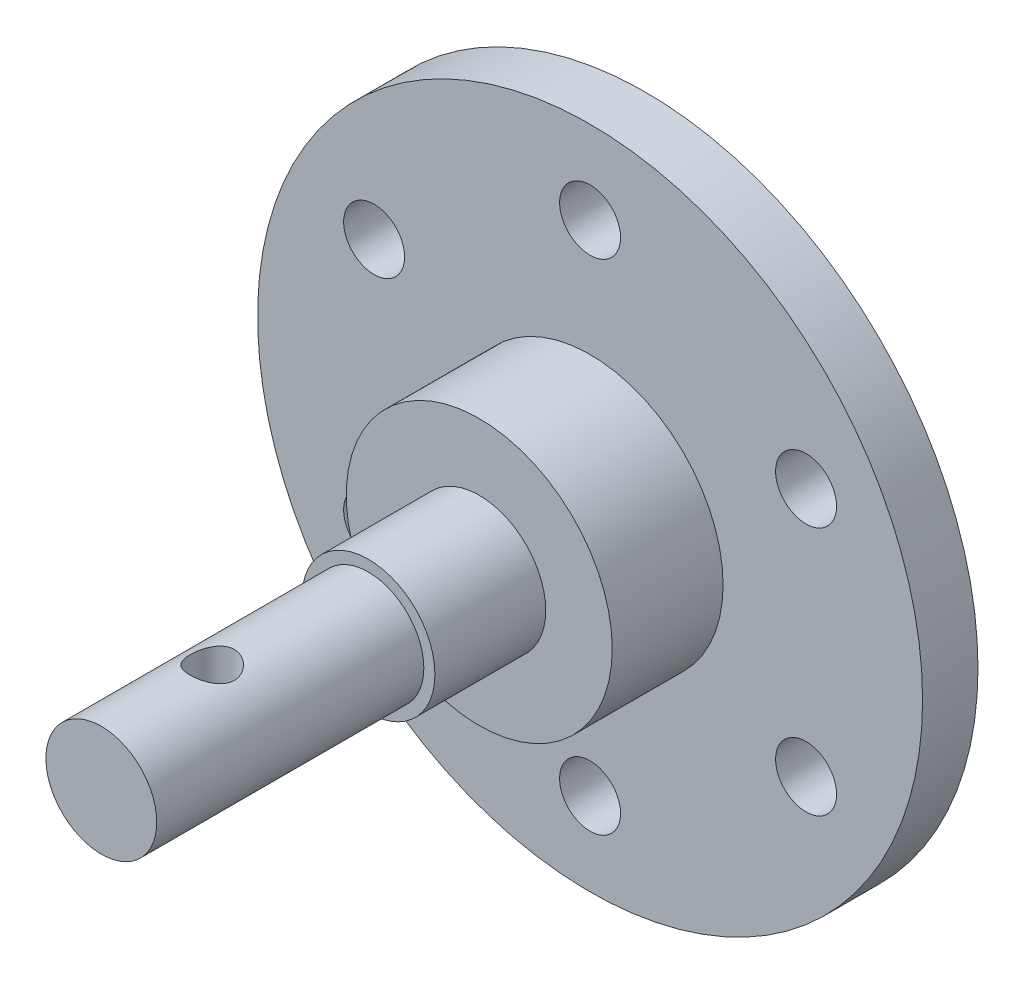
ISO-10303-21;
HEADER;
FILE_DESCRIPTION(('STEP AP214'),'2;1');
FILE_NAME('part.step','',(''),(''),'','','');
FILE_SCHEMA(('AUTOMOTIVE_DESIGN { 1 0 10303 214 1 1 1 1 }'));
ENDSEC;
DATA;
#1=APPLICATION_CONTEXT('core data for automotive mechanical design processes');
#2=APPLICATION_PROTOCOL_DEFINITION('international standard','automotive_design',2000,#1);
#3=PRODUCT_CONTEXT('',#1,'mechanical');
#4=PRODUCT('Part','Part','',(#3));
#5=PRODUCT_RELATED_PRODUCT_CATEGORY('part','',(#4));
#6=PRODUCT_DEFINITION_FORMATION('','',#4);
#7=PRODUCT_DEFINITION_CONTEXT('part definition',#1,'design');
#8=PRODUCT_DEFINITION('design','',#6,#7);
#9=PRODUCT_DEFINITION_SHAPE('','',#8);
#10=(LENGTH_UNIT() NAMED_UNIT(*) SI_UNIT(.MILLI.,.METRE.));
#11=(NAMED_UNIT(*) PLANE_ANGLE_UNIT() SI_UNIT($,.RADIAN.));
#12=(NAMED_UNIT(*) SI_UNIT($,.STERADIAN.) SOLID_ANGLE_UNIT());
#13=UNCERTAINTY_MEASURE_WITH_UNIT(LENGTH_MEASURE(1.E-05),#10,'distance_accuracy_value','');
#14=(GEOMETRIC_REPRESENTATION_CONTEXT(3) GLOBAL_UNCERTAINTY_ASSIGNED_CONTEXT((#13)) GLOBAL_UNIT_ASSIGNED_CONTEXT((#10,
#11,#12)) REPRESENTATION_CONTEXT('',''));
#15=CARTESIAN_POINT('',(0.,0.,0.));
#16=DIRECTION('',(0.,0.,1.));
#17=DIRECTION('',(1.,0.,0.));
#18=AXIS2_PLACEMENT_3D('',#15,#16,#17);
#19=CARTESIAN_POINT('',(0.,0.,49.1));
#20=DIRECTION('',(0.,0.,-1.));
#21=DIRECTION('',(-1.,0.,0.));
#22=AXIS2_PLACEMENT_3D('',#19,#20,#21);
#23=CYLINDRICAL_SURFACE('',#22,5.);
#24=CARTESIAN_POINT('',(0.,0.,49.1));
#25=DIRECTION('',(0.,0.,1.));
#26=DIRECTION('',(1.,0.,0.));
#27=AXIS2_PLACEMENT_3D('',#24,#25,#26);
#28=CIRCLE('',#27,5.);
#29=CARTESIAN_POINT('',(5.,0.,49.1));
#30=VERTEX_POINT('',#29);
#31=EDGE_CURVE('E54',#30,#30,#28,.T.);
#32=ORIENTED_EDGE('',*,*,#31,.F.);
#33=EDGE_LOOP('',(#32));
#34=FACE_BOUND('',#33,.T.);
#35=CARTESIAN_POINT('',(0.,0.,25.));
#36=DIRECTION('',(0.,0.,1.));
#37=DIRECTION('',(1.,0.,0.));
#38=AXIS2_PLACEMENT_3D('',#35,#36,#37);
#39=CIRCLE('',#38,5.);
#40=CARTESIAN_POINT('',(5.,0.,25.));
#41=VERTEX_POINT('',#40);
#42=EDGE_CURVE('E10',#41,#41,#39,.T.);
#43=ORIENTED_EDGE('',*,*,#42,.T.);
#44=EDGE_LOOP('',(#43));
#45=FACE_BOUND('',#44,.T.);
#46=CARTESIAN_POINT('',(0.,-5.,37.1));
#47=CARTESIAN_POINT('',(0.107493005442891,-4.99999271227085,37.1000098518237));
#48=CARTESIAN_POINT('',(0.215172564090672,-4.99649294306933,37.1087177520884));
#49=CARTESIAN_POINT('',(0.427496480417895,-4.98283453100642,37.1432477035212));
#50=CARTESIAN_POINT('',(0.532131777561248,-4.97265778698877,37.1691162790861));
#51=CARTESIAN_POINT('',(0.734953922727402,-4.94674209213118,37.2368760780588));
#52=CARTESIAN_POINT('',(0.833160661616957,-4.93102136364072,37.2787148462167));
#53=CARTESIAN_POINT('',(1.02107197032836,-4.89556610796078,37.3770191733265));
#54=CARTESIAN_POINT('',(1.11077947675099,-4.87583297458057,37.4334796549189));
#55=CARTESIAN_POINT('',(1.28350100757039,-4.83330886170419,37.5622354985609));
#56=CARTESIAN_POINT('',(1.36606227255022,-4.81042296929191,37.6351066562403));
#57=CARTESIAN_POINT('',(1.51817500478472,-4.76460576906194,37.7934000034768));
#58=CARTESIAN_POINT('',(1.58772010713353,-4.74167444453792,37.8788282972117));
#59=CARTESIAN_POINT('',(1.71487456729288,-4.69722791797136,38.0644280702423));
#60=CARTESIAN_POINT('',(1.77181498119547,-4.67582115964951,38.1650864860232));
#61=CARTESIAN_POINT('',(1.86775471903715,-4.63833647186793,38.37553639842));
#62=CARTESIAN_POINT('',(1.90676256428583,-4.62225601244176,38.4853235278484));
#63=CARTESIAN_POINT('',(1.96389882339587,-4.59826357660818,38.7057123335921));
#64=CARTESIAN_POINT('',(1.98289396580565,-4.59001420355605,38.8160512355762));
#65=CARTESIAN_POINT('',(2.00217296164003,-4.58164004049144,39.0386349983073));
#66=CARTESIAN_POINT('',(2.00246601631322,-4.58151125522768,39.150878894625));
#67=CARTESIAN_POINT('',(1.98498936750454,-4.58910500279994,39.3657566714581));
#68=CARTESIAN_POINT('',(1.96847531430514,-4.5962817503845,39.468515714409));
#69=CARTESIAN_POINT('',(1.91994688029782,-4.61676187607836,39.6696595560067));
#70=CARTESIAN_POINT('',(1.88792979480463,-4.63006632321673,39.7680435881103));
#71=CARTESIAN_POINT('',(1.80869473255107,-4.6615948508853,39.960017836196));
#72=CARTESIAN_POINT('',(1.76117986231532,-4.67991379280788,40.0534692390547));
#73=CARTESIAN_POINT('',(1.65250646073221,-4.7193811638989,40.2314158163616));
#74=CARTESIAN_POINT('',(1.59134280510084,-4.74053065456848,40.3159076094028));
#75=CARTESIAN_POINT('',(1.45155059945443,-4.78526736742271,40.480409728802));
#76=CARTESIAN_POINT('',(1.37193746297063,-4.80891664976152,40.559568729446));
#77=CARTESIAN_POINT('',(1.20031442743019,-4.85459824958282,40.703684478002));
#78=CARTESIAN_POINT('',(1.10830206533443,-4.87663024445325,40.7686383974103));
#79=CARTESIAN_POINT('',(0.912077652605841,-4.91714681264548,40.8836174474158));
#80=CARTESIAN_POINT('',(0.807660491346475,-4.93555270095415,40.9333222811971));
#81=CARTESIAN_POINT('',(0.591023765482879,-4.96614828328759,41.0141678610781));
#82=CARTESIAN_POINT('',(0.478808196849671,-4.97834113462382,41.0453180375574));
#83=CARTESIAN_POINT('',(0.256895887607818,-4.99456139506911,41.0864482954197));
#84=CARTESIAN_POINT('',(0.147443293985534,-4.99902945833514,41.0975724542536));
#85=CARTESIAN_POINT('',(-0.0718453098078175,-5.00068478510631,41.1017131005286));
#86=CARTESIAN_POINT('',(-0.181681213223924,-4.99787393582291,41.0947342815475));
#87=CARTESIAN_POINT('',(-0.393432739121986,-4.98557567063753,41.063708247448));
#88=CARTESIAN_POINT('',(-0.495482491775472,-4.97639391345523,41.040442019649));
#89=CARTESIAN_POINT('',(-0.694135428060778,-4.952594414055,40.9785642916902));
#90=CARTESIAN_POINT('',(-0.790737910224844,-4.9379759735653,40.9399508203313));
#91=CARTESIAN_POINT('',(-0.979078785816701,-4.90416594770812,40.8472150603201));
#92=CARTESIAN_POINT('',(-1.0705780227554,-4.88484815979804,40.7926545279569));
#93=CARTESIAN_POINT('',(-1.24344359124655,-4.84373364745525,40.6700596760944));
#94=CARTESIAN_POINT('',(-1.32480584076112,-4.82193593110271,40.6020199570774));
#95=CARTESIAN_POINT('',(-1.48072304302882,-4.77645117638112,40.4491299870504));
#96=CARTESIAN_POINT('',(-1.55447393380606,-4.75273441425052,40.3634664584938));
#97=CARTESIAN_POINT('',(-1.68675119741371,-4.70741672917132,40.1805599169906));
#98=CARTESIAN_POINT('',(-1.74527506133751,-4.68581615526511,40.0833149996601));
#99=CARTESIAN_POINT('',(-1.84580750193163,-4.64714299907709,39.8785383054059));
#100=CARTESIAN_POINT('',(-1.88765059453445,-4.63011630884788,39.7709160007877));
#101=CARTESIAN_POINT('',(-1.9522962197053,-4.60323673477931,39.5492663482849));
#102=CARTESIAN_POINT('',(-1.97511280526931,-4.59337855695998,39.4352437941876));
#103=CARTESIAN_POINT('',(-1.9997156172784,-4.58271759299926,39.2128720982255));
#104=CARTESIAN_POINT('',(-2.00289708230287,-4.58131421008171,39.1047051604067));
#105=CARTESIAN_POINT('',(-1.99180315927752,-4.58614836033098,38.8894551422867));
#106=CARTESIAN_POINT('',(-1.97752998791378,-4.59238492324794,38.7823719260974));
#107=CARTESIAN_POINT('',(-1.93307136615365,-4.61126649079021,38.576667810145));
#108=CARTESIAN_POINT('',(-1.90353749357098,-4.62364831827449,38.477879725567));
#109=CARTESIAN_POINT('',(-1.83000544849101,-4.65324001232697,38.2866213703865));
#110=CARTESIAN_POINT('',(-1.78600328139381,-4.67045121206007,38.1941528531002));
#111=CARTESIAN_POINT('',(-1.68187276275973,-4.70898609604492,38.0123903807292));
#112=CARTESIAN_POINT('',(-1.62096533515949,-4.73048882313242,37.9235813298695));
#113=CARTESIAN_POINT('',(-1.48589211927149,-4.77463804372237,37.7570066827962));
#114=CARTESIAN_POINT('',(-1.41172233481812,-4.79728488048406,37.6792444278717));
#115=CARTESIAN_POINT('',(-1.24650550627246,-4.84293567087394,37.5317971467364));
#116=CARTESIAN_POINT('',(-1.15467600114614,-4.86586757962185,37.4629626931019));
#117=CARTESIAN_POINT('',(-0.95990032028578,-4.90800406713717,37.3416629573784));
#118=CARTESIAN_POINT('',(-0.85694900454724,-4.92720691092906,37.2892052878475));
#119=CARTESIAN_POINT('',(-0.644738062495206,-4.95939714815861,37.2033777848097));
#120=CARTESIAN_POINT('',(-0.535631618219698,-4.97249363055028,37.1696706764397));
#121=CARTESIAN_POINT('',(-0.312876546281221,-4.99144306209366,37.1213608790457));
#122=CARTESIAN_POINT('',(-0.199243525858912,-4.99731899495638,37.1066975632561));
#123=CARTESIAN_POINT('',(-0.0569122978909287,-4.99975899504136,37.1006046190217));
#124=CARTESIAN_POINT('',(-0.0284626887407579,-5.00000192969176,37.0999973913708));
#125=CARTESIAN_POINT('',(0.,-5.,37.1));
#126=B_SPLINE_CURVE_WITH_KNOTS('',3,(#46,#47,#48,#49,#50,#51,#52,#53,#54,#55,#56,#57,#58,#59,
#60,#61,#62,#63,#64,#65,#66,#67,#68,#69,#70,#71,#72,#73,#74,#75,#76,#77,#78,#79,#80,#81,#82,#83,
#84,#85,#86,#87,#88,#89,#90,#91,#92,#93,#94,#95,#96,#97,#98,#99,#100,#101,#102,#103,#104,#105,
#106,#107,#108,#109,#110,#111,#112,#113,#114,#115,#116,#117,#118,#119,#120,#121,#122,#123,#124,
#125),.UNSPECIFIED.,.T.,.F.,(4,2,2,2,2,2,2,2,2,2,2,2,2,2,2,2,2,2,2,2,2,2,2,2,2,2,2,2,2,2,2,2,2,
2,2,2,2,2,2,4),(0.,0.32240298789307,0.645683636007934,0.967911457471577,1.29002753567984,
1.62597381700397,1.96208394934412,2.31315258819216,2.66405423118268,2.99904105308829,
3.33386306340488,3.64538328401372,3.95695787256048,4.27489126298816,4.59294421938184,
4.93558349186558,5.27829092839733,5.62776913162807,5.97706956113791,6.30569184528007,
6.63422893570082,6.94800455564365,7.26182048993796,7.58523513398262,7.90877959498969,
8.25368474624413,8.59864669043748,8.94695045140828,9.29499672645933,9.61799673392748,
9.94095572563046,10.2511431854877,10.5614163580516,10.8894546805669,11.2175920134839,
11.5670042353384,11.9165786364053,12.2596430101332,12.6016125240434,12.686980458968),.UNSPECIFIED.);
#127=CARTESIAN_POINT('',(0.,-5.,37.1));
#128=VERTEX_POINT('',#127);
#129=EDGE_CURVE('E104',#128,#128,#126,.T.);
#130=ORIENTED_EDGE('',*,*,#129,.F.);
#131=EDGE_LOOP('',(#130));
#132=FACE_BOUND('',#131,.T.);
#133=CARTESIAN_POINT('',(0.,5.,37.1));
#134=CARTESIAN_POINT('',(-0.107493005442891,4.99999271227085,37.1000098518237));
#135=CARTESIAN_POINT('',(-0.215172564090672,4.99649294306933,37.1087177520884));
#136=CARTESIAN_POINT('',(-0.427496480417895,4.98283453100642,37.1432477035212));
#137=CARTESIAN_POINT('',(-0.532131777561248,4.97265778698877,37.1691162790861));
#138=CARTESIAN_POINT('',(-0.734953922727402,4.94674209213118,37.2368760780588));
#139=CARTESIAN_POINT('',(-0.833160661616957,4.93102136364072,37.2787148462167));
#140=CARTESIAN_POINT('',(-1.02107197032836,4.89556610796078,37.3770191733265));
#141=CARTESIAN_POINT('',(-1.11077947675099,4.87583297458057,37.4334796549189));
#142=CARTESIAN_POINT('',(-1.28350100757039,4.83330886170419,37.5622354985609));
#143=CARTESIAN_POINT('',(-1.36606227255022,4.81042296929191,37.6351066562403));
#144=CARTESIAN_POINT('',(-1.51817500478472,4.76460576906194,37.7934000034768));
#145=CARTESIAN_POINT('',(-1.58772010713353,4.74167444453792,37.8788282972117));
#146=CARTESIAN_POINT('',(-1.71487456729288,4.69722791797136,38.0644280702423));
#147=CARTESIAN_POINT('',(-1.77181498119547,4.67582115964951,38.1650864860232));
#148=CARTESIAN_POINT('',(-1.86775471903715,4.63833647186793,38.37553639842));
#149=CARTESIAN_POINT('',(-1.90676256428583,4.62225601244176,38.4853235278484));
#150=CARTESIAN_POINT('',(-1.96389882339587,4.59826357660818,38.7057123335921));
#151=CARTESIAN_POINT('',(-1.98289396580565,4.59001420355605,38.8160512355762));
#152=CARTESIAN_POINT('',(-2.00217296164003,4.58164004049144,39.0386349983073));
#153=CARTESIAN_POINT('',(-2.00246601631322,4.58151125522768,39.150878894625));
#154=CARTESIAN_POINT('',(-1.98498936750454,4.58910500279994,39.3657566714581));
#155=CARTESIAN_POINT('',(-1.96847531430514,4.5962817503845,39.468515714409));
#156=CARTESIAN_POINT('',(-1.91994688029782,4.61676187607836,39.6696595560067));
#157=CARTESIAN_POINT('',(-1.88792979480463,4.63006632321673,39.7680435881103));
#158=CARTESIAN_POINT('',(-1.80869473255107,4.6615948508853,39.960017836196));
#159=CARTESIAN_POINT('',(-1.76117986231532,4.67991379280788,40.0534692390547));
#160=CARTESIAN_POINT('',(-1.65250646073221,4.7193811638989,40.2314158163616));
#161=CARTESIAN_POINT('',(-1.59134280510084,4.74053065456848,40.3159076094028));
#162=CARTESIAN_POINT('',(-1.45155059945443,4.78526736742271,40.480409728802));
#163=CARTESIAN_POINT('',(-1.37193746297063,4.80891664976152,40.559568729446));
#164=CARTESIAN_POINT('',(-1.20031442743019,4.85459824958282,40.703684478002));
#165=CARTESIAN_POINT('',(-1.10830206533443,4.87663024445325,40.7686383974103));
#166=CARTESIAN_POINT('',(-0.912077652605841,4.91714681264548,40.8836174474158));
#167=CARTESIAN_POINT('',(-0.807660491346475,4.93555270095415,40.9333222811971));
#168=CARTESIAN_POINT('',(-0.591023765482879,4.96614828328759,41.0141678610781));
#169=CARTESIAN_POINT('',(-0.478808196849671,4.97834113462382,41.0453180375574));
#170=CARTESIAN_POINT('',(-0.256895887607818,4.99456139506911,41.0864482954197));
#171=CARTESIAN_POINT('',(-0.147443293985534,4.99902945833514,41.0975724542536));
#172=CARTESIAN_POINT('',(0.0718453098078175,5.00068478510631,41.1017131005286));
#173=CARTESIAN_POINT('',(0.181681213223924,4.99787393582291,41.0947342815475));
#174=CARTESIAN_POINT('',(0.393432739121986,4.98557567063753,41.063708247448));
#175=CARTESIAN_POINT('',(0.495482491775472,4.97639391345523,41.040442019649));
#176=CARTESIAN_POINT('',(0.694135428060778,4.952594414055,40.9785642916902));
#177=CARTESIAN_POINT('',(0.790737910224844,4.9379759735653,40.9399508203313));
#178=CARTESIAN_POINT('',(0.979078785816701,4.90416594770812,40.8472150603201));
#179=CARTESIAN_POINT('',(1.0705780227554,4.88484815979804,40.7926545279569));
#180=CARTESIAN_POINT('',(1.24344359124655,4.84373364745525,40.6700596760944));
#181=CARTESIAN_POINT('',(1.32480584076112,4.82193593110271,40.6020199570774));
#182=CARTESIAN_POINT('',(1.48072304302882,4.77645117638112,40.4491299870504));
#183=CARTESIAN_POINT('',(1.55447393380606,4.75273441425052,40.3634664584938));
#184=CARTESIAN_POINT('',(1.68675119741371,4.70741672917132,40.1805599169906));
#185=CARTESIAN_POINT('',(1.74527506133751,4.68581615526511,40.0833149996601));
#186=CARTESIAN_POINT('',(1.84580750193163,4.64714299907709,39.8785383054059));
#187=CARTESIAN_POINT('',(1.88765059453445,4.63011630884788,39.7709160007877));
#188=CARTESIAN_POINT('',(1.9522962197053,4.60323673477931,39.5492663482849));
#189=CARTESIAN_POINT('',(1.97511280526931,4.59337855695998,39.4352437941876));
#190=CARTESIAN_POINT('',(1.9997156172784,4.58271759299926,39.2128720982255));
#191=CARTESIAN_POINT('',(2.00289708230287,4.58131421008171,39.1047051604067));
#192=CARTESIAN_POINT('',(1.99180315927752,4.58614836033098,38.8894551422867));
#193=CARTESIAN_POINT('',(1.97752998791378,4.59238492324794,38.7823719260974));
#194=CARTESIAN_POINT('',(1.93307136615365,4.61126649079021,38.576667810145));
#195=CARTESIAN_POINT('',(1.90353749357098,4.62364831827449,38.477879725567));
#196=CARTESIAN_POINT('',(1.83000544849101,4.65324001232697,38.2866213703865));
#197=CARTESIAN_POINT('',(1.78600328139381,4.67045121206007,38.1941528531002));
#198=CARTESIAN_POINT('',(1.68187276275973,4.70898609604492,38.0123903807292));
#199=CARTESIAN_POINT('',(1.62096533515949,4.73048882313242,37.9235813298695));
#200=CARTESIAN_POINT('',(1.48589211927149,4.77463804372237,37.7570066827962));
#201=CARTESIAN_POINT('',(1.41172233481812,4.79728488048406,37.6792444278717));
#202=CARTESIAN_POINT('',(1.24650550627246,4.84293567087394,37.5317971467364));
#203=CARTESIAN_POINT('',(1.15467600114614,4.86586757962185,37.4629626931019));
#204=CARTESIAN_POINT('',(0.95990032028578,4.90800406713717,37.3416629573784));
#205=CARTESIAN_POINT('',(0.85694900454724,4.92720691092906,37.2892052878475));
#206=CARTESIAN_POINT('',(0.644738062495206,4.95939714815861,37.2033777848097));
#207=CARTESIAN_POINT('',(0.535631618219698,4.97249363055028,37.1696706764397));
#208=CARTESIAN_POINT('',(0.312876546281221,4.99144306209366,37.1213608790457));
#209=CARTESIAN_POINT('',(0.199243525858912,4.99731899495638,37.1066975632561));
#210=CARTESIAN_POINT('',(0.0569122978909287,4.99975899504136,37.1006046190217));
#211=CARTESIAN_POINT('',(0.0284626887407579,5.00000192969176,37.0999973913708));
#212=CARTESIAN_POINT('',(0.,5.,37.1));
#213=B_SPLINE_CURVE_WITH_KNOTS('',3,(#133,#134,#135,#136,#137,#138,#139,#140,#141,#142,#143,
#144,#145,#146,#147,#148,#149,#150,#151,#152,#153,#154,#155,#156,#157,#158,#159,#160,#161,#162,
#163,#164,#165,#166,#167,#168,#169,#170,#171,#172,#173,#174,#175,#176,#177,#178,#179,#180,#181,
#182,#183,#184,#185,#186,#187,#188,#189,#190,#191,#192,#193,#194,#195,#196,#197,#198,#199,#200,
#201,#202,#203,#204,#205,#206,#207,#208,#209,#210,#211,#212),.UNSPECIFIED.,.T.,.F.,(4,2,2,2,2,2,
2,2,2,2,2,2,2,2,2,2,2,2,2,2,2,2,2,2,2,2,2,2,2,2,2,2,2,2,2,2,2,2,2,4),(0.,0.32240298789307,
0.645683636007934,0.967911457471577,1.29002753567984,1.62597381700397,1.96208394934412,
2.31315258819216,2.66405423118268,2.99904105308829,3.33386306340488,3.64538328401372,
3.95695787256048,4.27489126298816,4.59294421938184,4.93558349186558,5.27829092839733,
5.62776913162807,5.97706956113791,6.30569184528007,6.63422893570082,6.94800455564365,
7.26182048993796,7.58523513398262,7.90877959498969,8.25368474624413,8.59864669043748,
8.94695045140828,9.29499672645933,9.61799673392748,9.94095572563046,10.2511431854877,
10.5614163580516,10.8894546805669,11.2175920134839,11.5670042353384,11.9165786364053,
12.2596430101332,12.6016125240434,12.686980458968),.UNSPECIFIED.);
#214=CARTESIAN_POINT('',(0.,5.,37.1));
#215=VERTEX_POINT('',#214);
#216=EDGE_CURVE('E37',#215,#215,#213,.T.);
#217=ORIENTED_EDGE('',*,*,#216,.F.);
#218=EDGE_LOOP('',(#217));
#219=FACE_BOUND('',#218,.T.);
#220=ADVANCED_FACE('F33',(#34,#45,#132,#219),#23,.T.);
#221=CARTESIAN_POINT('',(0.,0.,5.));
#222=DIRECTION('',(0.,0.,1.));
#223=DIRECTION('',(1.,0.,0.));
#224=AXIS2_PLACEMENT_3D('',#221,#222,#223);
#225=PLANE('',#224);
#226=CARTESIAN_POINT('',(0.,0.,5.));
#227=DIRECTION('',(0.,0.,1.));
#228=DIRECTION('',(1.,0.,0.));
#229=AXIS2_PLACEMENT_3D('',#226,#227,#228);
#230=CIRCLE('',#229,12.);
#231=CARTESIAN_POINT('',(12.,0.,5.));
#232=VERTEX_POINT('',#231);
#233=EDGE_CURVE('E57',#232,#232,#230,.T.);
#234=ORIENTED_EDGE('',*,*,#233,.F.);
#235=EDGE_LOOP('',(#234));
#236=FACE_BOUND('',#235,.T.);
#237=CARTESIAN_POINT('',(-19.4855715851484,-11.2500000000008,5.));
#238=DIRECTION('',(0.,0.,1.));
#239=DIRECTION('',(1.,0.,0.));
#240=AXIS2_PLACEMENT_3D('',#237,#238,#239);
#241=CIRCLE('',#240,2.75000000000183);
#242=CARTESIAN_POINT('',(-16.7355715851466,-11.2500000000008,5.));
#243=VERTEX_POINT('',#242);
#244=EDGE_CURVE('E71',#243,#243,#241,.T.);
#245=ORIENTED_EDGE('',*,*,#244,.F.);
#246=EDGE_LOOP('',(#245));
#247=FACE_BOUND('',#246,.T.);
#248=CARTESIAN_POINT('',(19.4855715851513,-11.2499999999992,5.));
#249=DIRECTION('',(0.,0.,1.));
#250=DIRECTION('',(1.,0.,0.));
#251=AXIS2_PLACEMENT_3D('',#248,#249,#250);
#252=CIRCLE('',#251,2.75000000000123);
#253=CARTESIAN_POINT('',(22.2355715851525,-11.2499999999992,5.));
#254=VERTEX_POINT('',#253);
#255=EDGE_CURVE('E83',#254,#254,#252,.T.);
#256=ORIENTED_EDGE('',*,*,#255,.F.);
#257=EDGE_LOOP('',(#256));
#258=FACE_BOUND('',#257,.T.);
#259=CARTESIAN_POINT('',(0.,22.5,5.));
#260=DIRECTION('',(0.,0.,1.));
#261=DIRECTION('',(1.,0.,0.));
#262=AXIS2_PLACEMENT_3D('',#259,#260,#261);
#263=CIRCLE('',#262,2.75);
#264=CARTESIAN_POINT('',(2.75,22.5,5.));
#265=VERTEX_POINT('',#264);
#266=EDGE_CURVE('E95',#265,#265,#263,.T.);
#267=ORIENTED_EDGE('',*,*,#266,.F.);
#268=EDGE_LOOP('',(#267));
#269=FACE_BOUND('',#268,.T.);
#270=CARTESIAN_POINT('',(0.,0.,5.));
#271=DIRECTION('',(0.,0.,1.));
#272=DIRECTION('',(1.,0.,0.));
#273=AXIS2_PLACEMENT_3D('',#270,#271,#272);
#274=CIRCLE('',#273,30.);
#275=CARTESIAN_POINT('',(30.,0.,5.));
#276=VERTEX_POINT('',#275);
#277=EDGE_CURVE('E50',#276,#276,#274,.T.);
#278=ORIENTED_EDGE('',*,*,#277,.T.);
#279=EDGE_LOOP('',(#278));
#280=FACE_BOUND('',#279,.T.);
#281=CARTESIAN_POINT('',(19.4855715851503,11.2500000000008,5.));
#282=DIRECTION('',(0.,0.,1.));
#283=DIRECTION('',(1.,0.,0.));
#284=AXIS2_PLACEMENT_3D('',#281,#282,#283);
#285=CIRCLE('',#284,2.75000000000027);
#286=CARTESIAN_POINT('',(22.2355715851506,11.2500000000008,5.));
#287=VERTEX_POINT('',#286);
#288=EDGE_CURVE('E89',#287,#287,#285,.T.);
#289=ORIENTED_EDGE('',*,*,#288,.F.);
#290=EDGE_LOOP('',(#289));
#291=FACE_BOUND('',#290,.T.);
#292=CARTESIAN_POINT('',(1.91295447595611E-12,-22.5,5.));
#293=DIRECTION('',(0.,0.,1.));
#294=DIRECTION('',(1.,0.,0.));
#295=AXIS2_PLACEMENT_3D('',#292,#293,#294);
#296=CIRCLE('',#295,2.75000000000198);
#297=CARTESIAN_POINT('',(2.75000000000389,-22.5,5.));
#298=VERTEX_POINT('',#297);
#299=EDGE_CURVE('E77',#298,#298,#296,.T.);
#300=ORIENTED_EDGE('',*,*,#299,.F.);
#301=EDGE_LOOP('',(#300));
#302=FACE_BOUND('',#301,.T.);
#303=CARTESIAN_POINT('',(-19.4855715851494,11.2499999999992,5.));
#304=DIRECTION('',(0.,0.,1.));
#305=DIRECTION('',(1.,0.,0.));
#306=AXIS2_PLACEMENT_3D('',#303,#304,#305);
#307=CIRCLE('',#306,2.75000000000097);
#308=CARTESIAN_POINT('',(-16.7355715851484,11.2499999999992,5.));
#309=VERTEX_POINT('',#308);
#310=EDGE_CURVE('E65',#309,#309,#307,.T.);
#311=ORIENTED_EDGE('',*,*,#310,.F.);
#312=EDGE_LOOP('',(#311));
#313=FACE_BOUND('',#312,.T.);
#314=ADVANCED_FACE('F127',(#236,#247,#258,#269,#280,#291,#302,#313),#225,.T.);
#315=CARTESIAN_POINT('',(0.,0.,0.));
#316=DIRECTION('',(0.,0.,1.));
#317=DIRECTION('',(1.,0.,0.));
#318=AXIS2_PLACEMENT_3D('',#315,#316,#317);
#319=PLANE('',#318);
#320=CARTESIAN_POINT('',(0.,0.,0.));
#321=DIRECTION('',(0.,0.,1.));
#322=DIRECTION('',(1.,0.,0.));
#323=AXIS2_PLACEMENT_3D('',#320,#321,#322);
#324=CIRCLE('',#323,30.);
#325=CARTESIAN_POINT('',(30.,0.,0.));
#326=VERTEX_POINT('',#325);
#327=EDGE_CURVE('E98',#326,#326,#324,.T.);
#328=ORIENTED_EDGE('',*,*,#327,.F.);
#329=EDGE_LOOP('',(#328));
#330=FACE_BOUND('',#329,.T.);
#331=CARTESIAN_POINT('',(0.,22.5,0.));
#332=DIRECTION('',(0.,0.,1.));
#333=DIRECTION('',(1.,0.,0.));
#334=AXIS2_PLACEMENT_3D('',#331,#332,#333);
#335=CIRCLE('',#334,2.75);
#336=CARTESIAN_POINT('',(2.75,22.5,0.));
#337=VERTEX_POINT('',#336);
#338=EDGE_CURVE('E92',#337,#337,#335,.T.);
#339=ORIENTED_EDGE('',*,*,#338,.T.);
#340=EDGE_LOOP('',(#339));
#341=FACE_BOUND('',#340,.T.);
#342=CARTESIAN_POINT('',(19.4855715851503,11.2500000000008,0.));
#343=DIRECTION('',(0.,0.,1.));
#344=DIRECTION('',(1.,0.,0.));
#345=AXIS2_PLACEMENT_3D('',#342,#343,#344);
#346=CIRCLE('',#345,2.75000000000027);
#347=CARTESIAN_POINT('',(22.2355715851506,11.2500000000008,0.));
#348=VERTEX_POINT('',#347);
#349=EDGE_CURVE('E86',#348,#348,#346,.T.);
#350=ORIENTED_EDGE('',*,*,#349,.T.);
#351=EDGE_LOOP('',(#350));
#352=FACE_BOUND('',#351,.T.);
#353=CARTESIAN_POINT('',(19.4855715851513,-11.2499999999992,0.));
#354=DIRECTION('',(0.,0.,1.));
#355=DIRECTION('',(1.,0.,0.));
#356=AXIS2_PLACEMENT_3D('',#353,#354,#355);
#357=CIRCLE('',#356,2.75000000000123);
#358=CARTESIAN_POINT('',(22.2355715851525,-11.2499999999992,0.));
#359=VERTEX_POINT('',#358);
#360=EDGE_CURVE('E80',#359,#359,#357,.T.);
#361=ORIENTED_EDGE('',*,*,#360,.T.);
#362=EDGE_LOOP('',(#361));
#363=FACE_BOUND('',#362,.T.);
#364=CARTESIAN_POINT('',(1.91295447595611E-12,-22.5,0.));
#365=DIRECTION('',(0.,0.,1.));
#366=DIRECTION('',(1.,0.,0.));
#367=AXIS2_PLACEMENT_3D('',#364,#365,#366);
#368=CIRCLE('',#367,2.75000000000198);
#369=CARTESIAN_POINT('',(2.75000000000389,-22.5,0.));
#370=VERTEX_POINT('',#369);
#371=EDGE_CURVE('E74',#370,#370,#368,.T.);
#372=ORIENTED_EDGE('',*,*,#371,.T.);
#373=EDGE_LOOP('',(#372));
#374=FACE_BOUND('',#373,.T.);
#375=CARTESIAN_POINT('',(-19.4855715851484,-11.2500000000008,0.));
#376=DIRECTION('',(0.,0.,1.));
#377=DIRECTION('',(1.,0.,0.));
#378=AXIS2_PLACEMENT_3D('',#375,#376,#377);
#379=CIRCLE('',#378,2.75000000000183);
#380=CARTESIAN_POINT('',(-16.7355715851466,-11.2500000000008,0.));
#381=VERTEX_POINT('',#380);
#382=EDGE_CURVE('E68',#381,#381,#379,.T.);
#383=ORIENTED_EDGE('',*,*,#382,.T.);
#384=EDGE_LOOP('',(#383));
#385=FACE_BOUND('',#384,.T.);
#386=CARTESIAN_POINT('',(-19.4855715851494,11.2499999999992,0.));
#387=DIRECTION('',(0.,0.,1.));
#388=DIRECTION('',(1.,0.,0.));
#389=AXIS2_PLACEMENT_3D('',#386,#387,#388);
#390=CIRCLE('',#389,2.75000000000097);
#391=CARTESIAN_POINT('',(-16.7355715851484,11.2499999999992,0.));
#392=VERTEX_POINT('',#391);
#393=EDGE_CURVE('E62',#392,#392,#390,.T.);
#394=ORIENTED_EDGE('',*,*,#393,.T.);
#395=EDGE_LOOP('',(#394));
#396=FACE_BOUND('',#395,.T.);
#397=ADVANCED_FACE('F132',(#330,#341,#352,#363,#374,#385,#396),#319,.F.);
#398=CARTESIAN_POINT('',(0.,0.,5.));
#399=DIRECTION('',(0.,0.,-1.));
#400=DIRECTION('',(-1.,0.,0.));
#401=AXIS2_PLACEMENT_3D('',#398,#399,#400);
#402=CYLINDRICAL_SURFACE('',#401,30.);
#403=ORIENTED_EDGE('',*,*,#277,.F.);
#404=EDGE_LOOP('',(#403));
#405=FACE_BOUND('',#404,.T.);
#406=ORIENTED_EDGE('',*,*,#327,.T.);
#407=EDGE_LOOP('',(#406));
#408=FACE_BOUND('',#407,.T.);
#409=ADVANCED_FACE('F35',(#405,#408),#402,.T.);
#410=CARTESIAN_POINT('',(0.,22.5,5.));
#411=DIRECTION('',(0.,0.,-1.));
#412=DIRECTION('',(-1.,0.,0.));
#413=AXIS2_PLACEMENT_3D('',#410,#411,#412);
#414=CYLINDRICAL_SURFACE('',#413,2.75);
#415=ORIENTED_EDGE('',*,*,#266,.T.);
#416=EDGE_LOOP('',(#415));
#417=FACE_BOUND('',#416,.T.);
#418=ORIENTED_EDGE('',*,*,#338,.F.);
#419=EDGE_LOOP('',(#418));
#420=FACE_BOUND('',#419,.T.);
#421=ADVANCED_FACE('F149',(#417,#420),#414,.F.);
#422=CARTESIAN_POINT('',(19.4855715851503,11.2500000000008,5.));
#423=DIRECTION('',(0.,0.,-1.));
#424=DIRECTION('',(-1.,0.,0.));
#425=AXIS2_PLACEMENT_3D('',#422,#423,#424);
#426=CYLINDRICAL_SURFACE('',#425,2.75000000000027);
#427=ORIENTED_EDGE('',*,*,#288,.T.);
#428=EDGE_LOOP('',(#427));
#429=FACE_BOUND('',#428,.T.);
#430=ORIENTED_EDGE('',*,*,#349,.F.);
#431=EDGE_LOOP('',(#430));
#432=FACE_BOUND('',#431,.T.);
#433=ADVANCED_FACE('F152',(#429,#432),#426,.F.);
#434=CARTESIAN_POINT('',(19.4855715851513,-11.2499999999992,5.));
#435=DIRECTION('',(0.,0.,-1.));
#436=DIRECTION('',(-1.,0.,0.));
#437=AXIS2_PLACEMENT_3D('',#434,#435,#436);
#438=CYLINDRICAL_SURFACE('',#437,2.75000000000123);
#439=ORIENTED_EDGE('',*,*,#255,.T.);
#440=EDGE_LOOP('',(#439));
#441=FACE_BOUND('',#440,.T.);
#442=ORIENTED_EDGE('',*,*,#360,.F.);
#443=EDGE_LOOP('',(#442));
#444=FACE_BOUND('',#443,.T.);
#445=ADVANCED_FACE('F156',(#441,#444),#438,.F.);
#446=CARTESIAN_POINT('',(1.91295447595611E-12,-22.5,5.));
#447=DIRECTION('',(0.,0.,-1.));
#448=DIRECTION('',(-1.,0.,0.));
#449=AXIS2_PLACEMENT_3D('',#446,#447,#448);
#450=CYLINDRICAL_SURFACE('',#449,2.75000000000198);
#451=ORIENTED_EDGE('',*,*,#299,.T.);
#452=EDGE_LOOP('',(#451));
#453=FACE_BOUND('',#452,.T.);
#454=ORIENTED_EDGE('',*,*,#371,.F.);
#455=EDGE_LOOP('',(#454));
#456=FACE_BOUND('',#455,.T.);
#457=ADVANCED_FACE('F160',(#453,#456),#450,.F.);
#458=CARTESIAN_POINT('',(-19.4855715851484,-11.2500000000008,5.));
#459=DIRECTION('',(0.,0.,-1.));
#460=DIRECTION('',(-1.,0.,0.));
#461=AXIS2_PLACEMENT_3D('',#458,#459,#460);
#462=CYLINDRICAL_SURFACE('',#461,2.75000000000183);
#463=ORIENTED_EDGE('',*,*,#244,.T.);
#464=EDGE_LOOP('',(#463));
#465=FACE_BOUND('',#464,.T.);
#466=ORIENTED_EDGE('',*,*,#382,.F.);
#467=EDGE_LOOP('',(#466));
#468=FACE_BOUND('',#467,.T.);
#469=ADVANCED_FACE('F164',(#465,#468),#462,.F.);
#470=CARTESIAN_POINT('',(-19.4855715851494,11.2499999999992,5.));
#471=DIRECTION('',(0.,0.,-1.));
#472=DIRECTION('',(-1.,0.,0.));
#473=AXIS2_PLACEMENT_3D('',#470,#471,#472);
#474=CYLINDRICAL_SURFACE('',#473,2.75000000000097);
#475=ORIENTED_EDGE('',*,*,#310,.T.);
#476=EDGE_LOOP('',(#475));
#477=FACE_BOUND('',#476,.T.);
#478=ORIENTED_EDGE('',*,*,#393,.F.);
#479=EDGE_LOOP('',(#478));
#480=FACE_BOUND('',#479,.T.);
#481=ADVANCED_FACE('F168',(#477,#480),#474,.F.);
#482=CARTESIAN_POINT('',(0.,0.,15.));
#483=DIRECTION('',(0.,0.,-1.));
#484=DIRECTION('',(-1.,0.,0.));
#485=AXIS2_PLACEMENT_3D('',#482,#483,#484);
#486=CYLINDRICAL_SURFACE('',#485,12.);
#487=CARTESIAN_POINT('',(0.,0.,15.));
#488=DIRECTION('',(0.,0.,1.));
#489=DIRECTION('',(1.,0.,0.));
#490=AXIS2_PLACEMENT_3D('',#487,#488,#489);
#491=CIRCLE('',#490,12.);
#492=CARTESIAN_POINT('',(12.,0.,15.));
#493=VERTEX_POINT('',#492);
#494=EDGE_CURVE('E59',#493,#493,#491,.T.);
#495=ORIENTED_EDGE('',*,*,#494,.F.);
#496=EDGE_LOOP('',(#495));
#497=FACE_BOUND('',#496,.T.);
#498=ORIENTED_EDGE('',*,*,#233,.T.);
#499=EDGE_LOOP('',(#498));
#500=FACE_BOUND('',#499,.T.);
#501=ADVANCED_FACE('F172',(#497,#500),#486,.T.);
#502=CARTESIAN_POINT('',(0.,0.,15.));
#503=DIRECTION('',(0.,0.,1.));
#504=DIRECTION('',(1.,0.,0.));
#505=AXIS2_PLACEMENT_3D('',#502,#503,#504);
#506=PLANE('',#505);
#507=CARTESIAN_POINT('',(0.,0.,15.));
#508=DIRECTION('',(0.,0.,1.));
#509=DIRECTION('',(1.,0.,0.));
#510=AXIS2_PLACEMENT_3D('',#507,#508,#509);
#511=CIRCLE('',#510,6.);
#512=CARTESIAN_POINT('',(6.,0.,15.));
#513=VERTEX_POINT('',#512);
#514=EDGE_CURVE('E45',#513,#513,#511,.T.);
#515=ORIENTED_EDGE('',*,*,#514,.F.);
#516=EDGE_LOOP('',(#515));
#517=FACE_BOUND('',#516,.T.);
#518=ORIENTED_EDGE('',*,*,#494,.T.);
#519=EDGE_LOOP('',(#518));
#520=FACE_BOUND('',#519,.T.);
#521=ADVANCED_FACE('F176',(#517,#520),#506,.T.);
#522=CARTESIAN_POINT('',(0.,0.,25.));
#523=DIRECTION('',(0.,0.,-1.));
#524=DIRECTION('',(-1.,0.,0.));
#525=AXIS2_PLACEMENT_3D('',#522,#523,#524);
#526=CYLINDRICAL_SURFACE('',#525,6.);
#527=CARTESIAN_POINT('',(0.,0.,25.));
#528=DIRECTION('',(0.,0.,1.));
#529=DIRECTION('',(1.,0.,0.));
#530=AXIS2_PLACEMENT_3D('',#527,#528,#529);
#531=CIRCLE('',#530,6.);
#532=CARTESIAN_POINT('',(6.,0.,25.));
#533=VERTEX_POINT('',#532);
#534=EDGE_CURVE('E55',#533,#533,#531,.T.);
#535=ORIENTED_EDGE('',*,*,#534,.F.);
#536=EDGE_LOOP('',(#535));
#537=FACE_BOUND('',#536,.T.);
#538=ORIENTED_EDGE('',*,*,#514,.T.);
#539=EDGE_LOOP('',(#538));
#540=FACE_BOUND('',#539,.T.);
#541=ADVANCED_FACE('F123',(#537,#540),#526,.T.);
#542=CARTESIAN_POINT('',(0.,0.,25.));
#543=DIRECTION('',(0.,0.,1.));
#544=DIRECTION('',(1.,0.,0.));
#545=AXIS2_PLACEMENT_3D('',#542,#543,#544);
#546=PLANE('',#545);
#547=ORIENTED_EDGE('',*,*,#42,.F.);
#548=EDGE_LOOP('',(#547));
#549=FACE_BOUND('',#548,.T.);
#550=ORIENTED_EDGE('',*,*,#534,.T.);
#551=EDGE_LOOP('',(#550));
#552=FACE_BOUND('',#551,.T.);
#553=ADVANCED_FACE('F118',(#549,#552),#546,.T.);
#554=CARTESIAN_POINT('',(0.,0.,49.1));
#555=DIRECTION('',(0.,0.,1.));
#556=DIRECTION('',(1.,0.,0.));
#557=AXIS2_PLACEMENT_3D('',#554,#555,#556);
#558=PLANE('',#557);
#559=ORIENTED_EDGE('',*,*,#31,.T.);
#560=EDGE_LOOP('',(#559));
#561=FACE_BOUND('',#560,.T.);
#562=ADVANCED_FACE('F114',(#561),#558,.T.);
#563=CARTESIAN_POINT('',(0.,10.,39.1));
#564=DIRECTION('',(0.,-1.,0.));
#565=DIRECTION('',(0.,0.,-1.));
#566=AXIS2_PLACEMENT_3D('',#563,#564,#565);
#567=CYLINDRICAL_SURFACE('',#566,2.);
#568=ORIENTED_EDGE('',*,*,#129,.T.);
#569=EDGE_LOOP('',(#568));
#570=FACE_BOUND('',#569,.T.);
#571=ORIENTED_EDGE('',*,*,#216,.T.);
#572=EDGE_LOOP('',(#571));
#573=FACE_BOUND('',#572,.T.);
#574=ADVANCED_FACE('F111',(#570,#573),#567,.F.);
#575=CLOSED_SHELL('',(#220,#314,#397,#409,#421,#433,#445,#457,#469,#481,#501,#521,#541,#553,
#562,#574));
#576=MANIFOLD_SOLID_BREP('B2',#575);
#577=ADVANCED_BREP_SHAPE_REPRESENTATION('',(#18,#576),#14);
#578=SHAPE_DEFINITION_REPRESENTATION(#9,#577);
ENDSEC;
END-ISO-10303-21;
